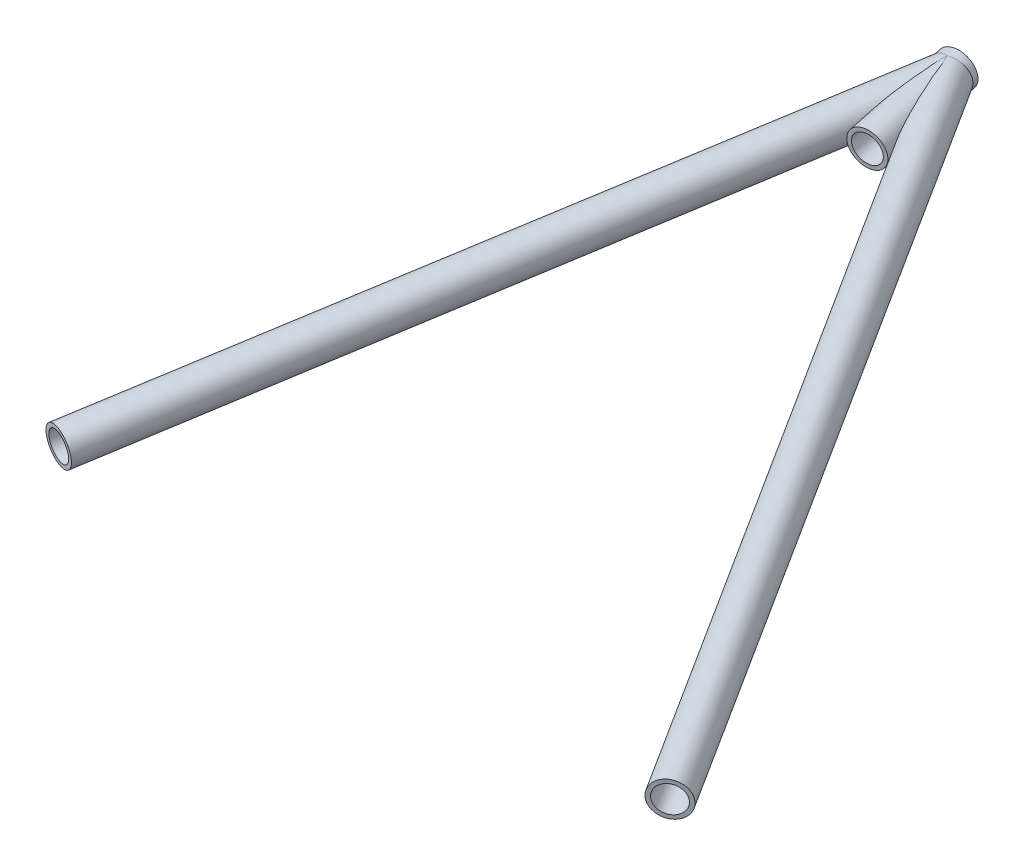
ISO-10303-21;
HEADER;
FILE_DESCRIPTION(('STEP AP214'),'2;1');
FILE_NAME('part.step','',(''),(''),'','','');
FILE_SCHEMA(('AUTOMOTIVE_DESIGN { 1 0 10303 214 1 1 1 1 }'));
ENDSEC;
DATA;
#1=APPLICATION_CONTEXT('core data for automotive mechanical design processes');
#2=APPLICATION_PROTOCOL_DEFINITION('international standard','automotive_design',2000,#1);
#3=PRODUCT_CONTEXT('',#1,'mechanical');
#4=PRODUCT('Part','Part','',(#3));
#5=PRODUCT_RELATED_PRODUCT_CATEGORY('part','',(#4));
#6=PRODUCT_DEFINITION_FORMATION('','',#4);
#7=PRODUCT_DEFINITION_CONTEXT('part definition',#1,'design');
#8=PRODUCT_DEFINITION('design','',#6,#7);
#9=PRODUCT_DEFINITION_SHAPE('','',#8);
#10=(LENGTH_UNIT() NAMED_UNIT(*) SI_UNIT(.MILLI.,.METRE.));
#11=(NAMED_UNIT(*) PLANE_ANGLE_UNIT() SI_UNIT($,.RADIAN.));
#12=(NAMED_UNIT(*) SI_UNIT($,.STERADIAN.) SOLID_ANGLE_UNIT());
#13=UNCERTAINTY_MEASURE_WITH_UNIT(LENGTH_MEASURE(1.E-05),#10,'distance_accuracy_value','');
#14=(GEOMETRIC_REPRESENTATION_CONTEXT(3) GLOBAL_UNCERTAINTY_ASSIGNED_CONTEXT((#13)) GLOBAL_UNIT_ASSIGNED_CONTEXT((#10,
#11,#12)) REPRESENTATION_CONTEXT('',''));
#15=CARTESIAN_POINT('',(0.,0.,0.));
#16=DIRECTION('',(0.,0.,1.));
#17=DIRECTION('',(1.,0.,0.));
#18=AXIS2_PLACEMENT_3D('',#15,#16,#17);
#19=CARTESIAN_POINT('',(1713.17260085528,131.13395858879,-611.724588998966));
#20=DIRECTION('',(0.512976736373104,-0.08229223970805,0.854448860508241));
#21=DIRECTION('',(0.857356807637054,0.,-0.514722550893585));
#22=AXIS2_PLACEMENT_3D('',#19,#20,#21);
#23=CYLINDRICAL_SURFACE('',#22,7.41680000000008);
#24=CARTESIAN_POINT('',(1932.04581422694,96.0220993887043,-247.154513007892));
#25=DIRECTION('',(-0.512976736373104,0.08229223970805,-0.854448860508241));
#26=DIRECTION('',(-0.857356807637054,0.,0.514722550893586));
#27=AXIS2_PLACEMENT_3D('',#24,#25,#26);
#28=CIRCLE('',#27,7.41680000000008);
#29=CARTESIAN_POINT('',(1925.68697025606,96.0220993887043,-243.336918792425));
#30=VERTEX_POINT('',#29);
#31=EDGE_CURVE('E109',#30,#30,#28,.T.);
#32=ORIENTED_EDGE('',*,*,#31,.F.);
#33=EDGE_LOOP('',(#32));
#34=FACE_BOUND('',#33,.T.);
#35=CARTESIAN_POINT('',(1723.05245629101,130.569114417633,-609.67734759782));
#36=CARTESIAN_POINT('',(1723.04654033207,130.377313286253,-609.687200454973));
#37=CARTESIAN_POINT('',(1723.03558764211,130.185341941127,-609.69093369608));
#38=CARTESIAN_POINT('',(1723.00385380998,129.802365240826,-609.685933915555));
#39=CARTESIAN_POINT('',(1722.98307189629,129.611359962669,-609.677199915247));
#40=CARTESIAN_POINT('',(1722.93212499311,129.231534671491,-609.646968784082));
#41=CARTESIAN_POINT('',(1722.90195592902,129.042715644421,-609.625466107161));
#42=CARTESIAN_POINT('',(1722.83291511719,128.668650539318,-609.569351607622));
#43=CARTESIAN_POINT('',(1722.79404354829,128.483404387946,-609.534740054384));
#44=CARTESIAN_POINT('',(1722.70843547749,128.117462600462,-609.451961973841));
#45=CARTESIAN_POINT('',(1722.66168551312,127.936775372678,-609.403772147867));
#46=CARTESIAN_POINT('',(1722.56153597079,127.581583555824,-609.293487379942));
#47=CARTESIAN_POINT('',(1722.50813634281,127.407079013274,-609.231392333392));
#48=CARTESIAN_POINT('',(1722.39615048155,127.065633452883,-609.093018034236));
#49=CARTESIAN_POINT('',(1722.33756721158,126.898688195146,-609.016746858512));
#50=CARTESIAN_POINT('',(1722.2168725192,126.573493043463,-608.849811285011));
#51=CARTESIAN_POINT('',(1722.15476126118,126.4152427451,-608.75914755742));
#52=CARTESIAN_POINT('',(1722.03096793333,126.113581909962,-608.566666492679));
#53=CARTESIAN_POINT('',(1721.9693382336,125.969855341315,-608.465310775417));
#54=CARTESIAN_POINT('',(1721.84639402671,125.69246511348,-608.249490273213));
#55=CARTESIAN_POINT('',(1721.78507950636,125.558801029791,-608.135026041785));
#56=CARTESIAN_POINT('',(1721.6646334476,125.302229610049,-607.893701630239));
#57=CARTESIAN_POINT('',(1721.605500971,125.179317619152,-607.766846865136));
#58=CARTESIAN_POINT('',(1721.49109552052,124.944525445904,-607.501715808001));
#59=CARTESIAN_POINT('',(1721.43582251283,124.832645166901,-607.363439616053));
#60=CARTESIAN_POINT('',(1721.33272886828,124.62429339617,-607.08269192494));
#61=CARTESIAN_POINT('',(1721.28469512182,124.527377197724,-606.940627421208));
#62=CARTESIAN_POINT('',(1721.1944119778,124.343384449913,-606.648543716566));
#63=CARTESIAN_POINT('',(1721.15216235441,124.256307516429,-606.498524826525));
#64=CARTESIAN_POINT('',(1721.07401202636,124.091430651227,-606.191864833834));
#65=CARTESIAN_POINT('',(1721.03811255351,124.013632520363,-606.035222453641));
#66=CARTESIAN_POINT('',(1720.97290333528,123.866616183222,-605.716645225286));
#67=CARTESIAN_POINT('',(1720.94359437323,123.79739899727,-605.55470975063));
#68=CARTESIAN_POINT('',(1720.8723843643,123.618606141324,-605.105911152147));
#69=CARTESIAN_POINT('',(1720.8371028269,123.516842924207,-604.814860950483));
#70=CARTESIAN_POINT('',(1720.78486574778,123.332410416336,-604.225156376746));
#71=CARTESIAN_POINT('',(1720.76792462366,123.249756187447,-603.926496210882));
#72=CARTESIAN_POINT('',(1720.75001694083,123.099486354441,-603.323894738933));
#73=CARTESIAN_POINT('',(1720.74910718808,123.031925065264,-603.019938471706));
#74=CARTESIAN_POINT('',(1720.75800604177,122.939832762813,-602.562493183076));
#75=CARTESIAN_POINT('',(1720.76268164796,122.910680083328,-602.409779309495));
#76=CARTESIAN_POINT('',(1720.77516899961,122.855135393918,-602.103974616504));
#77=CARTESIAN_POINT('',(1720.78298075231,122.82874339037,-601.950883796225));
#78=CARTESIAN_POINT('',(1720.80739152397,122.762324185192,-601.546358914043));
#79=CARTESIAN_POINT('',(1720.8264142541,122.724388011887,-601.294726988632));
#80=CARTESIAN_POINT('',(1720.87111220495,122.65413671667,-600.791254220738));
#81=CARTESIAN_POINT('',(1720.8967883909,122.621822411471,-600.539413353232));
#82=CARTESIAN_POINT('',(1720.95389437639,122.561995653237,-600.035689549966));
#83=CARTESIAN_POINT('',(1720.9853271153,122.534485667431,-599.783806658695));
#84=CARTESIAN_POINT('',(1721.05316611682,122.48365476674,-599.280282222038));
#85=CARTESIAN_POINT('',(1721.08957269973,122.460334121856,-599.028640693247));
#86=CARTESIAN_POINT('',(1721.20541931619,122.395777024535,-598.273050362963));
#87=CARTESIAN_POINT('',(1721.2913459101,122.360080490864,-597.769617080901));
#88=CARTESIAN_POINT('',(1721.47626198241,122.300612219466,-596.764658809902));
#89=CARTESIAN_POINT('',(1721.57524807191,122.27683739574,-596.263133360506));
#90=CARTESIAN_POINT('',(1721.78436439084,122.23932364899,-595.256904932338));
#91=CARTESIAN_POINT('',(1721.89459453669,122.225685601338,-594.752219132698));
#92=CARTESIAN_POINT('',(1722.12312635943,122.207789909182,-593.744498828002));
#93=CARTESIAN_POINT('',(1722.24142849574,122.203532799068,-593.241464418647));
#94=CARTESIAN_POINT('',(1722.48418017973,122.203856314525,-592.237913525998));
#95=CARTESIAN_POINT('',(1722.60861748857,122.208419987753,-591.737394062699));
#96=CARTESIAN_POINT('',(1722.86255967634,122.226169051773,-590.737814713578));
#97=CARTESIAN_POINT('',(1722.99206442808,122.239354226298,-590.238754791459));
#98=CARTESIAN_POINT('',(1723.28100577327,122.277897595185,-589.143972763658));
#99=CARTESIAN_POINT('',(1723.44131906471,122.305140156573,-588.548547422757));
#100=CARTESIAN_POINT('',(1723.76638569234,122.372789546001,-587.359614267569));
#101=CARTESIAN_POINT('',(1723.93113933475,122.413197284102,-586.766106588708));
#102=CARTESIAN_POINT('',(1724.26445112291,122.508571585529,-585.579406274474));
#103=CARTESIAN_POINT('',(1724.43301911512,122.563581033968,-584.986219810543));
#104=CARTESIAN_POINT('',(1724.77245515445,122.690081235806,-583.802371953746));
#105=CARTESIAN_POINT('',(1724.9433227723,122.761568952329,-583.211710116006));
#106=CARTESIAN_POINT('',(1725.28395037135,122.922852028021,-582.041913127049));
#107=CARTESIAN_POINT('',(1725.45369071435,123.012368096081,-581.46273469764));
#108=CARTESIAN_POINT('',(1725.70854870001,123.164262049089,-580.596887974645));
#109=CARTESIAN_POINT('',(1725.79357651002,123.217854859657,-580.308645039762));
#110=CARTESIAN_POINT('',(1725.96352599184,123.331737476364,-579.733454324624));
#111=CARTESIAN_POINT('',(1726.04844766716,123.392027054658,-579.446506500651));
#112=CARTESIAN_POINT('',(1726.21759670224,123.520037674093,-578.875547402489));
#113=CARTESIAN_POINT('',(1726.30182546207,123.587723554968,-578.591528703547));
#114=CARTESIAN_POINT('',(1726.4697104338,123.732098336937,-578.025622766102));
#115=CARTESIAN_POINT('',(1726.55336669129,123.808786512203,-577.743735357707));
#116=CARTESIAN_POINT('',(1726.71963907114,123.972912544411,-577.183196215688));
#117=CARTESIAN_POINT('',(1726.80225637319,124.060336709565,-576.904540846769));
#118=CARTESIAN_POINT('',(1726.96599963226,124.248574245335,-576.351380074664));
#119=CARTESIAN_POINT('',(1727.04712620244,124.349381964134,-576.076872973887));
#120=CARTESIAN_POINT('',(1727.14692251124,124.486025341449,-575.7380825857));
#121=CARTESIAN_POINT('',(1727.16671393903,124.513758726626,-575.670838503921));
#122=CARTESIAN_POINT('',(1727.2061294634,124.570382912259,-575.536787143864));
#123=CARTESIAN_POINT('',(1727.22575355519,124.599273745869,-575.469979878162));
#124=CARTESIAN_POINT('',(1727.28435196274,124.687820610514,-575.270262488974));
#125=CARTESIAN_POINT('',(1727.32304337925,124.749338742417,-575.138087416282));
#126=CARTESIAN_POINT('',(1727.39949081988,124.878245939998,-574.876121609656));
#127=CARTESIAN_POINT('',(1727.43724569603,124.945641793731,-574.746333847873));
#128=CARTESIAN_POINT('',(1727.51142644802,125.087293794141,-574.490227519062));
#129=CARTESIAN_POINT('',(1727.54785266501,125.161548162237,-574.363908063578));
#130=CARTESIAN_POINT('',(1727.63481611861,125.353286830789,-574.060510914929));
#131=CARTESIAN_POINT('',(1727.68440958377,125.475291895177,-573.885893473436));
#132=CARTESIAN_POINT('',(1727.75415421182,125.675294202062,-573.63650875239));
#133=CARTESIAN_POINT('',(1727.77661234912,125.744732936298,-573.555529408285));
#134=CARTESIAN_POINT('',(1727.81948762507,125.890180182632,-573.399161870165));
#135=CARTESIAN_POINT('',(1727.83990627244,125.966183759572,-573.323769553939));
#136=CARTESIAN_POINT('',(1727.88002988058,126.133948103504,-573.173052164775));
#137=CARTESIAN_POINT('',(1727.89944210014,126.226525571001,-573.098542132831));
#138=CARTESIAN_POINT('',(1727.93372089541,126.421592146569,-572.962511865748));
#139=CARTESIAN_POINT('',(1727.94859396864,126.524066807959,-572.900973102462));
#140=CARTESIAN_POINT('',(1727.9703688576,126.721305130092,-572.804172833107));
#141=CARTESIAN_POINT('',(1727.9781683592,126.814655300222,-572.766276163256));
#142=CARTESIAN_POINT('',(1727.9886360929,127.006497014591,-572.705943546994));
#143=CARTESIAN_POINT('',(1727.99131000185,127.104982746569,-572.683490513701));
#144=CARTESIAN_POINT('',(1727.99110333081,127.30466275826,-572.655718258056));
#145=CARTESIAN_POINT('',(1727.98820592868,127.405864328365,-572.650451056551));
#146=CARTESIAN_POINT('',(1727.97707313307,127.607437401087,-572.656874898471));
#147=CARTESIAN_POINT('',(1727.96883271801,127.707808032787,-572.66858190779));
#148=CARTESIAN_POINT('',(1727.94506210844,127.93076355568,-572.711846518752));
#149=CARTESIAN_POINT('',(1727.92819322461,128.052335118458,-572.747775707289));
#150=CARTESIAN_POINT('',(1727.88912348547,128.287701845822,-572.837620625341));
#151=CARTESIAN_POINT('',(1727.86691075087,128.401478949115,-572.89157653333));
#152=CARTESIAN_POINT('',(1727.82203384034,128.605973058439,-573.004270539063));
#153=CARTESIAN_POINT('',(1727.79983990089,128.697724245082,-573.061366303878));
#154=CARTESIAN_POINT('',(1727.75337965479,128.875670381991,-573.182972871904));
#155=CARTESIAN_POINT('',(1727.72911168024,128.96186076074,-573.247489657656));
#156=CARTESIAN_POINT('',(1727.67898802284,129.129385125038,-573.382324532379));
#157=CARTESIAN_POINT('',(1727.65312877933,129.210707352104,-573.45265576215));
#158=CARTESIAN_POINT('',(1727.60025467923,129.368843032192,-573.597718249923));
#159=CARTESIAN_POINT('',(1727.57324020902,129.445657972714,-573.672448039813));
#160=CARTESIAN_POINT('',(1727.50400492049,129.634361753042,-573.865271202049));
#161=CARTESIAN_POINT('',(1727.46119471828,129.743672367138,-573.985671502339));
#162=CARTESIAN_POINT('',(1727.37412769178,129.954798805285,-574.23241613044));
#163=CARTESIAN_POINT('',(1727.32987010012,130.056610557549,-574.358763627362));
#164=CARTESIAN_POINT('',(1727.24024816083,130.25407673097,-574.616167440291));
#165=CARTESIAN_POINT('',(1727.19488196415,130.349719737163,-574.747231824044));
#166=CARTESIAN_POINT('',(1727.10339164071,130.535605791726,-575.012882962832));
#167=CARTESIAN_POINT('',(1727.05726742402,130.625848193371,-575.147470136961));
#168=CARTESIAN_POINT('',(1726.96419798409,130.802161088826,-575.420224465398));
#169=CARTESIAN_POINT('',(1726.91724960088,130.888205239722,-575.558407506878));
#170=CARTESIAN_POINT('',(1726.82292803408,131.056178552793,-575.837109482565));
#171=CARTESIAN_POINT('',(1726.77555483459,131.138107560182,-575.977628504372));
#172=CARTESIAN_POINT('',(1726.68055076136,131.298234146016,-576.260438223727));
#173=CARTESIAN_POINT('',(1726.63292027664,131.376436193937,-576.402726527262));
#174=CARTESIAN_POINT('',(1726.53742703123,131.529605487745,-576.688947920995));
#175=CARTESIAN_POINT('',(1726.48956427451,131.604572788616,-576.832880983182));
#176=CARTESIAN_POINT('',(1726.34499967611,131.826243070369,-577.26898865864));
#177=CARTESIAN_POINT('',(1726.24803946553,131.968518096491,-577.563333408426));
#178=CARTESIAN_POINT('',(1726.05382647221,132.243381675934,-578.156436015282));
#179=CARTESIAN_POINT('',(1725.95657364764,132.375968768313,-578.455194529816));
#180=CARTESIAN_POINT('',(1725.76201376865,132.63297044007,-579.056367004211));
#181=CARTESIAN_POINT('',(1725.664706711,132.757380986967,-579.358782681936));
#182=CARTESIAN_POINT('',(1725.47029788569,132.999071352768,-579.966525491397));
#183=CARTESIAN_POINT('',(1725.37319612925,133.116350791504,-580.271852777352));
#184=CARTESIAN_POINT('',(1725.17915207025,133.344893093205,-580.885695794895));
#185=CARTESIAN_POINT('',(1725.08221069603,133.45614098482,-581.194217382211));
#186=CARTESIAN_POINT('',(1724.88888063237,133.672983142699,-581.813416551023));
#187=CARTESIAN_POINT('',(1724.79249195817,133.778577253542,-582.124094191524));
#188=CARTESIAN_POINT('',(1724.50444502648,134.087634640036,-583.058790705019));
#189=CARTESIAN_POINT('',(1724.31384217685,134.283446981898,-583.68567433358));
#190=CARTESIAN_POINT('',(1723.93686895751,134.657541361915,-584.945229958343));
#191=CARTESIAN_POINT('',(1723.7504950605,134.835838456078,-585.57789646304));
#192=CARTESIAN_POINT('',(1723.38318939233,135.177001527154,-586.849006701281));
#193=CARTESIAN_POINT('',(1723.20225810942,135.339866122437,-587.487450946495));
#194=CARTESIAN_POINT('',(1722.84786708533,135.651005369213,-588.768918344349));
#195=CARTESIAN_POINT('',(1722.67439715532,135.799300296471,-589.411933758914));
#196=CARTESIAN_POINT('',(1722.33699000706,136.08188502393,-590.703475440731));
#197=CARTESIAN_POINT('',(1722.17305190343,136.216176125836,-591.352001189706));
#198=CARTESIAN_POINT('',(1721.88774876259,136.446209178538,-592.531832471643));
#199=CARTESIAN_POINT('',(1721.76419403631,136.544439536494,-593.062122762843));
#200=CARTESIAN_POINT('',(1721.5278832215,136.730521618372,-594.127113710472));
#201=CARTESIAN_POINT('',(1721.41513000987,136.818370578741,-594.66181550091));
#202=CARTESIAN_POINT('',(1721.25669485208,136.941078243437,-595.467259549226));
#203=CARTESIAN_POINT('',(1721.20567214448,136.980464823488,-595.73626719979));
#204=CARTESIAN_POINT('',(1721.10774431697,137.055894834217,-596.275494325697));
#205=CARTESIAN_POINT('',(1721.06083905378,137.091938381242,-596.545713758522));
#206=CARTESIAN_POINT('',(1720.97180059786,137.160265669107,-597.087351620025));
#207=CARTESIAN_POINT('',(1720.92966628007,137.192550296421,-597.358769750276));
#208=CARTESIAN_POINT('',(1720.85094140363,137.25281788767,-597.902876119974));
#209=CARTESIAN_POINT('',(1720.81435057926,137.280801057791,-598.175564297895));
#210=CARTESIAN_POINT('',(1720.73779935068,137.339270311498,-598.802815188736));
#211=CARTESIAN_POINT('',(1720.70002641696,137.368061687218,-599.157812427505));
#212=CARTESIAN_POINT('',(1720.63780007058,137.415104339226,-599.86980885644));
#213=CARTESIAN_POINT('',(1720.61334964995,137.433353247891,-600.226808478138));
#214=CARTESIAN_POINT('',(1720.58089412748,137.456182895289,-600.941543828652));
#215=CARTESIAN_POINT('',(1720.57286492241,137.460783671366,-601.299277705975));
#216=CARTESIAN_POINT('',(1720.57684445117,137.451995329802,-602.014412921783));
#217=CARTESIAN_POINT('',(1720.5888405537,137.438617553472,-602.371814327721));
#218=CARTESIAN_POINT('',(1720.62728094086,137.397812353018,-602.94364577828));
#219=CARTESIAN_POINT('',(1720.64620477468,137.377961852585,-603.159123716042));
#220=CARTESIAN_POINT('',(1720.69358362457,137.327727439894,-603.587771761716));
#221=CARTESIAN_POINT('',(1720.72203547175,137.297347029626,-603.800942612632));
#222=CARTESIAN_POINT('',(1720.78890795805,137.224303600442,-604.22326985497));
#223=CARTESIAN_POINT('',(1720.82731262239,137.181660252263,-604.432432107867));
#224=CARTESIAN_POINT('',(1720.91415266722,137.082230302288,-604.845262561577));
#225=CARTESIAN_POINT('',(1720.96258603365,137.025446539838,-605.04893185627));
#226=CARTESIAN_POINT('',(1721.0606234992,136.906114628933,-605.417674337204));
#227=CARTESIAN_POINT('',(1721.10888200087,136.845824944191,-605.583835973428));
#228=CARTESIAN_POINT('',(1721.21131376055,136.713201416826,-605.909379685184));
#229=CARTESIAN_POINT('',(1721.26548584339,136.640869965699,-606.068763098999));
#230=CARTESIAN_POINT('',(1721.37857583728,136.483680020401,-606.379497782779));
#231=CARTESIAN_POINT('',(1721.43749415951,136.39882044037,-606.530848354961));
#232=CARTESIAN_POINT('',(1721.55856778639,136.216468401279,-606.824379270386));
#233=CARTESIAN_POINT('',(1721.62072316975,136.118975634999,-606.966559390491));
#234=CARTESIAN_POINT('',(1721.74662469165,135.91150064187,-607.241009108491));
#235=CARTESIAN_POINT('',(1721.81037246232,135.8015051529,-607.373267931014));
#236=CARTESIAN_POINT('',(1721.93760793841,135.569674836324,-607.627100692577));
#237=CARTESIAN_POINT('',(1722.00109563875,135.447839778569,-607.748674423824));
#238=CARTESIAN_POINT('',(1722.12611174923,135.193063895975,-607.980851517193));
#239=CARTESIAN_POINT('',(1722.18763896734,135.060116486008,-608.091448288288));
#240=CARTESIAN_POINT('',(1722.30709748487,134.78415020043,-608.301439824914));
#241=CARTESIAN_POINT('',(1722.36502878167,134.641131317514,-608.400834582319));
#242=CARTESIAN_POINT('',(1722.475145828,134.34807553776,-608.5871495931));
#243=CARTESIAN_POINT('',(1722.52739826433,134.198158618163,-608.674219388284));
#244=CARTESIAN_POINT('',(1722.6258899732,133.890641347062,-608.837505815819));
#245=CARTESIAN_POINT('',(1722.67212924149,133.733040990139,-608.913722440514));
#246=CARTESIAN_POINT('',(1722.75763864707,133.41130052742,-609.055370803047));
#247=CARTESIAN_POINT('',(1722.79691065637,133.247162192851,-609.12080543753));
#248=CARTESIAN_POINT('',(1722.86775060106,132.913411083176,-609.240995818702));
#249=CARTESIAN_POINT('',(1722.89931876247,132.743798468842,-609.295751878676));
#250=CARTESIAN_POINT('',(1722.95254974927,132.410446891782,-609.391690965734));
#251=CARTESIAN_POINT('',(1722.9746908399,132.246960449564,-609.433488491917));
#252=CARTESIAN_POINT('',(1723.01133528768,131.916973562253,-609.507713074967));
#253=CARTESIAN_POINT('',(1723.02583615056,131.750472151215,-609.540137070176));
#254=CARTESIAN_POINT('',(1723.0469838483,131.415397173538,-609.595571402671));
#255=CARTESIAN_POINT('',(1723.05362981834,131.246823380796,-609.61858070323));
#256=CARTESIAN_POINT('',(1723.05898350411,130.908582098071,-609.655106001696));
#257=CARTESIAN_POINT('',(1723.05769365864,130.738914960097,-609.668624914709));
#258=CARTESIAN_POINT('',(1723.05245629101,130.569114417633,-609.67734759782));
#259=B_SPLINE_CURVE_WITH_KNOTS('',3,(#35,#36,#37,#38,#39,#40,#41,#42,#43,#44,#45,#46,#47,#48,
#49,#50,#51,#52,#53,#54,#55,#56,#57,#58,#59,#60,#61,#62,#63,#64,#65,#66,#67,#68,#69,#70,#71,#72,
#73,#74,#75,#76,#77,#78,#79,#80,#81,#82,#83,#84,#85,#86,#87,#88,#89,#90,#91,#92,#93,#94,#95,#96,
#97,#98,#99,#100,#101,#102,#103,#104,#105,#106,#107,#108,#109,#110,#111,#112,#113,#114,#115,
#116,#117,#118,#119,#120,#121,#122,#123,#124,#125,#126,#127,#128,#129,#130,#131,#132,#133,#134,
#135,#136,#137,#138,#139,#140,#141,#142,#143,#144,#145,#146,#147,#148,#149,#150,#151,#152,#153,
#154,#155,#156,#157,#158,#159,#160,#161,#162,#163,#164,#165,#166,#167,#168,#169,#170,#171,#172,
#173,#174,#175,#176,#177,#178,#179,#180,#181,#182,#183,#184,#185,#186,#187,#188,#189,#190,#191,
#192,#193,#194,#195,#196,#197,#198,#199,#200,#201,#202,#203,#204,#205,#206,#207,#208,#209,#210,
#211,#212,#213,#214,#215,#216,#217,#218,#219,#220,#221,#222,#223,#224,#225,#226,#227,#228,#229,
#230,#231,#232,#233,#234,#235,#236,#237,#238,#239,#240,#241,#242,#243,#244,#245,#246,#247,#248,
#249,#250,#251,#252,#253,#254,#255,#256,#257,#258),.UNSPECIFIED.,.T.,.F.,(4,2,2,2,2,2,2,2,2,2,2,
2,2,2,2,2,2,2,2,2,2,2,2,2,2,2,2,2,2,2,2,2,2,2,2,2,2,2,2,2,2,2,2,2,2,2,2,2,2,2,2,2,2,2,2,2,2,2,2,
2,2,2,2,2,2,2,2,2,2,2,2,2,2,2,2,2,2,2,2,2,2,2,2,2,2,2,2,2,2,2,2,2,2,2,2,2,2,2,2,2,2,2,2,2,2,2,2,
2,2,2,2,4),(0.,0.5762905985785,1.15262643841304,1.72921279252587,2.30578729873162,
2.88335722553767,3.46093149720245,4.03817769780171,4.6153970269364,5.17374293840111,
5.73206528202877,6.2901447054839,6.84821923902869,7.38332139769753,7.91840265917229,
8.45358760228693,8.98883612112741,9.91821558798152,10.8483251209369,11.7817297668767,
12.248312295847,12.7148959022911,13.4802640933417,14.2457433798635,15.0116146248162,
15.7775352122352,17.3129644784832,18.8479960853233,20.3981061111411,21.9483044373709,
23.4955264560109,25.0427096648364,26.894241564471,28.7459014807718,30.6030610640594,
32.459878653906,34.289881738979,35.2056127640783,36.1213126427637,37.0328347320155,
37.9442833782823,38.8545814805171,39.7644963833476,39.9906376729429,40.2167854445226,
40.6691835878372,41.1221112955511,41.5749218759369,42.2294771016718,42.5562421436365,
42.8827636411422,43.2430896948133,43.602897517992,43.9047945559671,44.2063570346246,
44.5088314885144,44.8115906336242,45.1931073454155,45.5754801293267,45.9059684843568,
46.2367251587558,46.5682509340919,46.8996666764028,47.4037574122136,47.9081198753821,
48.4133903378055,48.9187211861735,49.426896527911,49.9350909696096,50.4426597895652,
50.9502199783058,51.972994654346,52.9959232479572,54.0193525981185,55.0428364607878,
56.0687542821779,57.0947002915324,59.145921824268,61.1953644200527,63.2449903239969,
65.2917222326139,67.3382637204383,68.9979468942732,70.6580708895933,71.4878942705656,
72.3176887604122,73.1472871597566,73.9768457805912,75.0509957550787,76.1253868682501,
77.1981998442995,78.2703363812202,78.9215935251996,79.5726342845615,80.2226364925022,
80.8725082872918,81.4216289862148,81.9706407594928,82.5197001456041,83.068772886459,
83.6184335829981,84.1681049664559,84.7181044239535,85.2681042804134,85.8107211981469,
86.3533384986249,86.8958097832951,87.4382651506712,87.9483864345856,88.4586741506583,
88.9690180434485,89.4792051083131),.UNSPECIFIED.);
#260=CARTESIAN_POINT('',(1723.05245629101,130.569114417633,-609.67734759782));
#261=VERTEX_POINT('',#260);
#262=EDGE_CURVE('E83',#261,#261,#259,.T.);
#263=ORIENTED_EDGE('',*,*,#262,.T.);
#264=EDGE_LOOP('',(#263));
#265=FACE_BOUND('',#264,.T.);
#266=ADVANCED_FACE('F65',(#34,#265),#23,.F.);
#267=CARTESIAN_POINT('',(1719.75176820433,126.102654339161,-562.415355233465));
#268=DIRECTION('',(-0.131583346980973,0.100626084992588,-0.98618467531003));
#269=DIRECTION('',(-0.991215775128284,0.,0.132254629925897));
#270=AXIS2_PLACEMENT_3D('',#267,#268,#269);
#271=CYLINDRICAL_SURFACE('',#270,9.52500000000004);
#272=ORIENTED_EDGE('',*,*,#262,.F.);
#273=EDGE_LOOP('',(#272));
#274=FACE_BOUND('',#273,.T.);
#275=CARTESIAN_POINT('',(1713.17260085528,131.13395858879,-611.724588998964));
#276=DIRECTION('',(0.944230002344393,0.0453897924229676,-0.326143326493902));
#277=DIRECTION('',(0.329060742994004,-0.0933834430453637,0.93968003064087));
#278=AXIS2_PLACEMENT_3D('',#275,#276,#277);
#279=ELLIPSE('',#278,47.1628036692757,9.525);
#280=CARTESIAN_POINT('',(1713.28876294306,121.660440805419,-612.706725536065));
#281=VERTEX_POINT('',#280);
#282=CARTESIAN_POINT('',(1713.05643876749,140.607476372162,-610.742452461863));
#283=VERTEX_POINT('',#282);
#284=EDGE_CURVE('E74',#281,#283,#279,.F.);
#285=ORIENTED_EDGE('',*,*,#284,.T.);
#286=CARTESIAN_POINT('',(1713.17260085528,131.13395858879,-611.724588998964));
#287=DIRECTION('',(0.329060742994004,-0.0933834430453637,0.93968003064087));
#288=DIRECTION('',(0.944230002344393,0.0453897924229676,-0.326143326493902));
#289=AXIS2_PLACEMENT_3D('',#286,#287,#288);
#290=ELLIPSE('',#289,9.72540390868764,9.525);
#291=EDGE_CURVE('E13',#283,#281,#290,.F.);
#292=ORIENTED_EDGE('',*,*,#291,.T.);
#293=EDGE_LOOP('',(#285,#292));
#294=FACE_BOUND('',#293,.T.);
#295=ADVANCED_FACE('F81',(#274,#294),#271,.F.);
#296=CARTESIAN_POINT('',(1713.17260085528,131.13395858879,-611.724588998966));
#297=DIRECTION('',(0.512976736373104,-0.08229223970805,0.854448860508241));
#298=DIRECTION('',(0.857356807637054,0.,-0.514722550893585));
#299=AXIS2_PLACEMENT_3D('',#296,#297,#298);
#300=CYLINDRICAL_SURFACE('',#299,9.52499999999996);
#301=CARTESIAN_POINT('',(1932.04581422694,96.0220993887043,-247.154513007892));
#302=DIRECTION('',(-0.512976736373104,0.08229223970805,-0.854448860508241));
#303=DIRECTION('',(-0.857356807637054,0.,0.514722550893586));
#304=AXIS2_PLACEMENT_3D('',#301,#302,#303);
#305=CIRCLE('',#304,9.52499999999996);
#306=CARTESIAN_POINT('',(1923.8794906342,96.0220993887043,-242.251780710631));
#307=VERTEX_POINT('',#306);
#308=EDGE_CURVE('E69',#307,#307,#305,.T.);
#309=ORIENTED_EDGE('',*,*,#308,.T.);
#310=EDGE_LOOP('',(#309));
#311=FACE_BOUND('',#310,.T.);
#312=ORIENTED_EDGE('',*,*,#284,.F.);
#313=ORIENTED_EDGE('',*,*,#291,.F.);
#314=EDGE_LOOP('',(#312,#313));
#315=FACE_BOUND('',#314,.T.);
#316=ADVANCED_FACE('F67',(#311,#315),#300,.T.);
#317=CARTESIAN_POINT('',(1932.04581422694,96.0220993887044,-247.154513007892));
#318=DIRECTION('',(-0.512976736373104,0.08229223970805,-0.854448860508241));
#319=DIRECTION('',(-0.857356807637054,0.,0.514722550893586));
#320=AXIS2_PLACEMENT_3D('',#317,#318,#319);
#321=PLANE('',#320);
#322=ORIENTED_EDGE('',*,*,#31,.T.);
#323=EDGE_LOOP('',(#322));
#324=FACE_BOUND('',#323,.T.);
#325=ORIENTED_EDGE('',*,*,#308,.F.);
#326=EDGE_LOOP('',(#325));
#327=FACE_BOUND('',#326,.T.);
#328=ADVANCED_FACE('F86',(#324,#327),#321,.F.);
#329=CLOSED_SHELL('',(#266,#295,#316,#328));
#330=MANIFOLD_SOLID_BREP('B2',#329);
#331=CARTESIAN_POINT('',(1600.,88.8502518080079,-217.248802890104));
#332=DIRECTION('',(0.274316838299431,0.102490644096067,-0.956162088820811));
#333=DIRECTION('',(-0.961223924389069,0.,-0.275769046816492));
#334=AXIS2_PLACEMENT_3D('',#331,#332,#333);
#335=CYLINDRICAL_SURFACE('',#334,7.41680000000008);
#336=CARTESIAN_POINT('',(1609.60108934048,92.4374243513702,-250.714475998832));
#337=DIRECTION('',(0.274316838299431,0.102490644096067,-0.956162088820811));
#338=DIRECTION('',(-0.96122392438907,0.,-0.275769046816492));
#339=AXIS2_PLACEMENT_3D('',#336,#337,#338);
#340=CIRCLE('',#339,7.41680000000008);
#341=CARTESIAN_POINT('',(1602.47188373807,92.4374243513702,-252.759799865261));
#342=VERTEX_POINT('',#341);
#343=EDGE_CURVE('E184',#342,#342,#340,.T.);
#344=ORIENTED_EDGE('',*,*,#343,.F.);
#345=EDGE_LOOP('',(#344));
#346=FACE_BOUND('',#345,.T.);
#347=CARTESIAN_POINT('',(1704.16915790004,130.433703385095,-607.237048483694));
#348=CARTESIAN_POINT('',(1704.16399077324,130.626588998975,-607.219033881927));
#349=CARTESIAN_POINT('',(1704.16540530266,130.819281558209,-607.196394251857));
#350=CARTESIAN_POINT('',(1704.1813770738,131.202905341836,-607.141967483448));
#351=CARTESIAN_POINT('',(1704.19594213303,131.393835450306,-607.11017491168));
#352=CARTESIAN_POINT('',(1704.23805567209,131.772948573631,-607.037340005222));
#353=CARTESIAN_POINT('',(1704.26563419309,131.961124188121,-606.996276383592));
#354=CARTESIAN_POINT('',(1704.33337705444,132.332881747878,-606.904804568348));
#355=CARTESIAN_POINT('',(1704.37354129535,132.516463729427,-606.854396448566));
#356=CARTESIAN_POINT('',(1704.46585660825,132.877707098577,-606.743964816532));
#357=CARTESIAN_POINT('',(1704.51801205661,133.055366297404,-606.683937796158));
#358=CARTESIAN_POINT('',(1704.63346009951,133.403286266749,-606.553931925536));
#359=CARTESIAN_POINT('',(1704.69675315362,133.573546731618,-606.48395266466));
#360=CARTESIAN_POINT('',(1704.83331810417,133.905100084552,-606.33369454951));
#361=CARTESIAN_POINT('',(1704.90658128143,134.066400636664,-606.253424698183));
#362=CARTESIAN_POINT('',(1705.06175584714,134.378797186812,-606.082104958726));
#363=CARTESIAN_POINT('',(1705.14366685982,134.529893627774,-605.991055538972));
#364=CARTESIAN_POINT('',(1705.31230561934,134.816867969547,-605.800247785144));
#365=CARTESIAN_POINT('',(1705.39885802946,134.953035062472,-605.700769615719));
#366=CARTESIAN_POINT('',(1705.57681119888,135.213328221495,-605.490980346471));
#367=CARTESIAN_POINT('',(1705.66821180405,135.337454669997,-605.380669590911));
#368=CARTESIAN_POINT('',(1705.85382700765,135.572722291596,-605.14926990721));
#369=CARTESIAN_POINT('',(1705.94804002065,135.68387061347,-605.02818697812));
#370=CARTESIAN_POINT('',(1706.13725119627,135.892690198147,-604.775482834942));
#371=CARTESIAN_POINT('',(1706.23224932658,135.990362012752,-604.64386205268));
#372=CARTESIAN_POINT('',(1706.41567781871,136.166926011533,-604.378432153677));
#373=CARTESIAN_POINT('',(1706.50417605965,136.2465673442,-604.245166606849));
#374=CARTESIAN_POINT('',(1706.67857074584,136.393926755853,-603.970580827279));
#375=CARTESIAN_POINT('',(1706.76446696554,136.461643803552,-603.829259899254));
#376=CARTESIAN_POINT('',(1706.93239928544,136.585669705703,-603.539554155033));
#377=CARTESIAN_POINT('',(1707.0144360059,136.641980398076,-603.391170481633));
#378=CARTESIAN_POINT('',(1707.17378151406,136.744005633777,-603.088357015416));
#379=CARTESIAN_POINT('',(1707.25108965166,136.789718722529,-602.93392639602));
#380=CARTESIAN_POINT('',(1707.44038371105,136.893396174057,-602.536022305));
#381=CARTESIAN_POINT('',(1707.54878656909,136.944824515549,-602.289125749296));
#382=CARTESIAN_POINT('',(1707.75247874519,137.028694357763,-601.786850906199));
#383=CARTESIAN_POINT('',(1707.84776019078,137.061124497766,-601.531467640095));
#384=CARTESIAN_POINT('',(1708.02604618595,137.110606759745,-601.013989913246));
#385=CARTESIAN_POINT('',(1708.10900409329,137.127601643368,-600.751874149483));
#386=CARTESIAN_POINT('',(1708.22473684975,137.143669300373,-600.355899556627));
#387=CARTESIAN_POINT('',(1708.26186164549,137.147454467461,-600.223449800737));
#388=CARTESIAN_POINT('',(1708.33338801329,137.152200737703,-599.957761109431));
#389=CARTESIAN_POINT('',(1708.36778954049,137.15316179436,-599.824522161058));
#390=CARTESIAN_POINT('',(1708.44942647965,137.152409095601,-599.495357474075));
#391=CARTESIAN_POINT('',(1708.49519756677,137.14924493869,-599.299071555874));
#392=CARTESIAN_POINT('',(1708.58177429116,137.138250861155,-598.905529270086));
#393=CARTESIAN_POINT('',(1708.6225792987,137.130420349541,-598.708272782716));
#394=CARTESIAN_POINT('',(1708.73833105913,137.10090371449,-598.115329075253));
#395=CARTESIAN_POINT('',(1708.80657666361,137.073193935801,-597.718624128738));
#396=CARTESIAN_POINT('',(1708.92880515216,137.005472217018,-596.92329265206));
#397=CARTESIAN_POINT('',(1708.98275683164,136.965433767667,-596.524663821032));
#398=CARTESIAN_POINT('',(1709.07900333903,136.875603000916,-595.727216647698));
#399=CARTESIAN_POINT('',(1709.12130068036,136.825812790586,-595.328398364866));
#400=CARTESIAN_POINT('',(1709.19665096414,136.71789460621,-594.528887392476));
#401=CARTESIAN_POINT('',(1709.229654071,136.65972412103,-594.128195887418));
#402=CARTESIAN_POINT('',(1709.28786577284,136.53639965335,-593.327318825368));
#403=CARTESIAN_POINT('',(1709.31307403592,136.471245373654,-592.927133290642));
#404=CARTESIAN_POINT('',(1709.35703549867,136.334811387598,-592.127969167727));
#405=CARTESIAN_POINT('',(1709.37579658543,136.263539299838,-591.72898970094));
#406=CARTESIAN_POINT('',(1709.40798272446,136.115300086116,-590.931886776615));
#407=CARTESIAN_POINT('',(1709.4214078519,136.03833304041,-590.533763307093));
#408=CARTESIAN_POINT('',(1709.44535232465,135.867841028585,-589.682741239436));
#409=CARTESIAN_POINT('',(1709.45520070472,135.77350727581,-589.229986054807));
#410=CARTESIAN_POINT('',(1709.47009611838,135.578041760709,-588.325865483068));
#411=CARTESIAN_POINT('',(1709.47514309684,135.476909920344,-587.874500111974));
#412=CARTESIAN_POINT('',(1709.48123733788,135.267813860281,-586.973134984571));
#413=CARTESIAN_POINT('',(1709.48228296977,135.15984687323,-586.523135859689));
#414=CARTESIAN_POINT('',(1709.48101556026,134.936952248108,-585.624873086335));
#415=CARTESIAN_POINT('',(1709.47870254397,134.822024662064,-585.176609424919));
#416=CARTESIAN_POINT('',(1709.47125905446,134.585342052899,-584.283806952574));
#417=CARTESIAN_POINT('',(1709.46613975769,134.463615822409,-583.839260421789));
#418=CARTESIAN_POINT('',(1709.45352300352,134.212417720048,-582.952395991245));
#419=CARTESIAN_POINT('',(1709.44602556707,134.082945916414,-582.51007807189));
#420=CARTESIAN_POINT('',(1709.42902011134,133.815580860101,-581.62817225892));
#421=CARTESIAN_POINT('',(1709.41951269354,133.677690135479,-581.188583589016));
#422=CARTESIAN_POINT('',(1709.3988024134,133.392482792036,-580.312528587989));
#423=CARTESIAN_POINT('',(1709.38759962831,133.245166602866,-579.87606211555));
#424=CARTESIAN_POINT('',(1709.36376858887,132.939613981955,-579.006476417877));
#425=CARTESIAN_POINT('',(1709.3511388534,132.781366271231,-578.573361178472));
#426=CARTESIAN_POINT('',(1709.32472839561,132.452214573828,-577.711902588916));
#427=CARTESIAN_POINT('',(1709.31094748304,132.281308495672,-577.283560040843));
#428=CARTESIAN_POINT('',(1709.2824856646,131.924016834577,-576.43267709632));
#429=CARTESIAN_POINT('',(1709.26780361115,131.737611401591,-576.010144973707));
#430=CARTESIAN_POINT('',(1709.24535307803,131.44360636238,-575.383193369539));
#431=CARTESIAN_POINT('',(1709.23779938082,131.343219827083,-575.175378386201));
#432=CARTESIAN_POINT('',(1709.22259600485,131.136930169088,-574.762515127525));
#433=CARTESIAN_POINT('',(1709.2149463332,131.031027453257,-574.557466649533));
#434=CARTESIAN_POINT('',(1709.19958197572,130.812486671093,-574.150150827668));
#435=CARTESIAN_POINT('',(1709.19186716128,130.699828538729,-573.947894212248));
#436=CARTESIAN_POINT('',(1709.17646573949,130.466889522875,-573.547728426182));
#437=CARTESIAN_POINT('',(1709.16877913899,130.346606904276,-573.349820259013));
#438=CARTESIAN_POINT('',(1709.15355679098,130.097284230531,-572.960439697486));
#439=CARTESIAN_POINT('',(1709.146020643,129.968273100749,-572.768948914667));
#440=CARTESIAN_POINT('',(1709.13121501297,129.699110048234,-572.394007423089));
#441=CARTESIAN_POINT('',(1709.12394537501,129.558964796189,-572.210552000877));
#442=CARTESIAN_POINT('',(1709.11104641765,129.288796893708,-571.884558424602));
#443=CARTESIAN_POINT('',(1709.10534427234,129.160915215822,-571.740261186631));
#444=CARTESIAN_POINT('',(1709.09445824003,128.892439006283,-571.462837002161));
#445=CARTESIAN_POINT('',(1709.08927595944,128.751807480566,-571.329744871698));
#446=CARTESIAN_POINT('',(1709.08213007569,128.528276160041,-571.142706714198));
#447=CARTESIAN_POINT('',(1709.07983787581,128.45103771948,-571.082052743143));
#448=CARTESIAN_POINT('',(1709.07554977839,128.292251742302,-570.966694784879));
#449=CARTESIAN_POINT('',(1709.07355399578,128.210702550664,-570.911993107943));
#450=CARTESIAN_POINT('',(1709.0681548384,127.959767072271,-570.75972908204));
#451=CARTESIAN_POINT('',(1709.065303165,127.783034870399,-570.673068743499));
#452=CARTESIAN_POINT('',(1709.06280265953,127.501006269178,-570.577977996882));
#453=CARTESIAN_POINT('',(1709.06227584546,127.401661116674,-570.551941453215));
#454=CARTESIAN_POINT('',(1709.06202871023,127.200041176651,-570.516263162299));
#455=CARTESIAN_POINT('',(1709.06230739466,127.097770155653,-570.506601223144));
#456=CARTESIAN_POINT('',(1709.06375434189,126.892521792185,-570.505655074531));
#457=CARTESIAN_POINT('',(1709.06492752349,126.789543675109,-570.514472954944));
#458=CARTESIAN_POINT('',(1709.06813903563,126.586875624883,-570.550573826572));
#459=CARTESIAN_POINT('',(1709.0701779496,126.487187958168,-570.577869277676));
#460=CARTESIAN_POINT('',(1709.07538510165,126.277879401098,-570.654491044928));
#461=CARTESIAN_POINT('',(1709.07868419607,126.169334899921,-570.706710114286));
#462=CARTESIAN_POINT('',(1709.0860061731,125.96216528738,-570.827950686729));
#463=CARTESIAN_POINT('',(1709.09003043545,125.863559653822,-570.897004310085));
#464=CARTESIAN_POINT('',(1709.10126833963,125.616684612715,-571.094692138435));
#465=CARTESIAN_POINT('',(1709.10888724803,125.476532907914,-571.233355264946));
#466=CARTESIAN_POINT('',(1709.12078415506,125.28241745357,-571.454909340815));
#467=CARTESIAN_POINT('',(1709.12483569725,125.220299210549,-571.531172066318));
#468=CARTESIAN_POINT('',(1709.13305328212,125.100773974994,-571.687311120382));
#469=CARTESIAN_POINT('',(1709.13721929417,125.043365738208,-571.76718648588));
#470=CARTESIAN_POINT('',(1709.14740159504,124.909345678928,-571.964016479692));
#471=CARTESIAN_POINT('',(1709.15345703899,124.834849244756,-572.082398374398));
#472=CARTESIAN_POINT('',(1709.16565414269,124.69283069754,-572.323294712721));
#473=CARTESIAN_POINT('',(1709.17179584038,124.625311769723,-572.445811010134));
#474=CARTESIAN_POINT('',(1709.19029556483,124.431345349097,-572.818320098886));
#475=CARTESIAN_POINT('',(1709.2027090471,124.313728679373,-573.072901498175));
#476=CARTESIAN_POINT('',(1709.2275131561,124.095303870824,-573.590528941382));
#477=CARTESIAN_POINT('',(1709.23990332846,123.994586298633,-573.853612111738));
#478=CARTESIAN_POINT('',(1709.25832601988,123.85375600026,-574.251656900667));
#479=CARTESIAN_POINT('',(1709.26443672826,123.808540823862,-574.384839280693));
#480=CARTESIAN_POINT('',(1709.27659581082,123.721146624098,-574.652197439012));
#481=CARTESIAN_POINT('',(1709.28264418577,123.678967563187,-574.786373204998));
#482=CARTESIAN_POINT('',(1709.30012691268,123.560267613846,-575.177724632728));
#483=CARTESIAN_POINT('',(1709.31146654512,123.487328285297,-575.435993029755));
#484=CARTESIAN_POINT('',(1709.33383103676,123.349648413009,-575.954733968382));
#485=CARTESIAN_POINT('',(1709.34485584968,123.284909069624,-576.215206826743));
#486=CARTESIAN_POINT('',(1709.36655005402,123.1623815033,-576.737923470458));
#487=CARTESIAN_POINT('',(1709.37721927041,123.104596667752,-577.00016805363));
#488=CARTESIAN_POINT('',(1709.39815597293,122.995080491629,-577.525939245815));
#489=CARTESIAN_POINT('',(1709.4084234371,122.943349481643,-577.789465924024));
#490=CARTESIAN_POINT('',(1709.4386109346,122.79587434035,-578.582780492336));
#491=CARTESIAN_POINT('',(1709.45786531846,122.708125268561,-579.114086226003));
#492=CARTESIAN_POINT('',(1709.49426707914,122.549705097764,-580.179106003707));
#493=CARTESIAN_POINT('',(1709.51141500725,122.479029525687,-580.712819379561));
#494=CARTESIAN_POINT('',(1709.54331397512,122.351684735568,-581.784373025253));
#495=CARTESIAN_POINT('',(1709.55805405654,122.295078973324,-582.322221102311));
#496=CARTESIAN_POINT('',(1709.5846044353,122.194329221052,-583.39917612962));
#497=CARTESIAN_POINT('',(1709.59641454597,122.150186024964,-583.938283157869));
#498=CARTESIAN_POINT('',(1709.61654936348,122.073071646796,-585.016478473016));
#499=CARTESIAN_POINT('',(1709.62487967253,122.040082523947,-585.555565382021));
#500=CARTESIAN_POINT('',(1709.63741574354,121.984253118731,-586.634295501938));
#501=CARTESIAN_POINT('',(1709.64162161168,121.96141257511,-587.173938698172));
#502=CARTESIAN_POINT('',(1709.64505801979,121.925381229934,-588.251090229805));
#503=CARTESIAN_POINT('',(1709.64431124718,121.912146733403,-588.788597029556));
#504=CARTESIAN_POINT('',(1709.63682654346,121.894894396309,-589.863735884522));
#505=CARTESIAN_POINT('',(1709.63008843893,121.890876822535,-590.401367942912));
#506=CARTESIAN_POINT('',(1709.60920712723,121.892120531363,-591.477496117757));
#507=CARTESIAN_POINT('',(1709.59505005824,121.897399227119,-592.015991964063));
#508=CARTESIAN_POINT('',(1709.55745965524,121.917724975147,-593.092448341506));
#509=CARTESIAN_POINT('',(1709.53402698396,121.932771329563,-593.630408908137));
#510=CARTESIAN_POINT('',(1709.47565255629,121.973420206059,-594.70031439072));
#511=CARTESIAN_POINT('',(1709.44082018929,121.998922956668,-595.232268613965));
#512=CARTESIAN_POINT('',(1709.37734912674,122.04641776905,-596.028850990422));
#513=CARTESIAN_POINT('',(1709.35431598531,122.063793866216,-596.294206301486));
#514=CARTESIAN_POINT('',(1709.30395646112,122.101965682977,-596.824258947076));
#515=CARTESIAN_POINT('',(1709.27663025016,122.122761265736,-597.0889563075));
#516=CARTESIAN_POINT('',(1709.21713667452,122.168129406935,-597.616749160661));
#517=CARTESIAN_POINT('',(1709.18498275903,122.192691476497,-597.87984705464));
#518=CARTESIAN_POINT('',(1709.11504132101,122.24617650225,-598.40483816618));
#519=CARTESIAN_POINT('',(1709.07725422859,122.275099125503,-598.666731474142));
#520=CARTESIAN_POINT('',(1708.99520613825,122.337990777741,-599.188729244897));
#521=CARTESIAN_POINT('',(1708.95094930273,122.37195656236,-599.448834746086));
#522=CARTESIAN_POINT('',(1708.85494904177,122.445851805056,-599.966788595205));
#523=CARTESIAN_POINT('',(1708.80320702645,122.485780139904,-600.224637358596));
#524=CARTESIAN_POINT('',(1708.72126513927,122.549373000157,-600.599308609502));
#525=CARTESIAN_POINT('',(1708.69445559333,122.570227635216,-600.717356134079));
#526=CARTESIAN_POINT('',(1708.6388755604,122.613605434678,-600.952679998296));
#527=CARTESIAN_POINT('',(1708.61010507045,122.636128601599,-601.069956336773));
#528=CARTESIAN_POINT('',(1708.520659749,122.706433626633,-601.420479490042));
#529=CARTESIAN_POINT('',(1708.45685468043,122.756948219132,-601.652403723956));
#530=CARTESIAN_POINT('',(1708.31985591664,122.866755420936,-602.111627032068));
#531=CARTESIAN_POINT('',(1708.2466537131,122.926055992796,-602.338921695789));
#532=CARTESIAN_POINT('',(1708.09000779849,123.055166466895,-602.786968593368));
#533=CARTESIAN_POINT('',(1708.00656391442,123.124976546652,-603.007720716639));
#534=CARTESIAN_POINT('',(1707.82727885195,123.278474155489,-603.444256118036));
#535=CARTESIAN_POINT('',(1707.73124545327,123.362384152969,-603.659883731961));
#536=CARTESIAN_POINT('',(1707.52797720841,123.545481673998,-604.079140830843));
#537=CARTESIAN_POINT('',(1707.42074255915,123.644668928994,-604.282770526619));
#538=CARTESIAN_POINT('',(1707.19646669719,123.860155904176,-604.674135330392));
#539=CARTESIAN_POINT('',(1707.07945577889,123.976403547477,-604.861916162523));
#540=CARTESIAN_POINT('',(1706.83774214772,124.227828535916,-605.218930217936));
#541=CARTESIAN_POINT('',(1706.71304310684,124.362996882737,-605.388172190131));
#542=CARTESIAN_POINT('',(1706.49526364806,124.612162845505,-605.660885828665));
#543=CARTESIAN_POINT('',(1706.40314348692,124.72143821993,-605.769476405285));
#544=CARTESIAN_POINT('',(1706.21848956574,124.950030558856,-605.975108126345));
#545=CARTESIAN_POINT('',(1706.12595587694,125.069345852556,-606.072151186011));
#546=CARTESIAN_POINT('',(1705.94218871558,125.317732393605,-606.254417253161));
#547=CARTESIAN_POINT('',(1705.85095590601,125.446808418024,-606.339634414243));
#548=CARTESIAN_POINT('',(1705.67158939021,125.714088690626,-606.498201555222));
#549=CARTESIAN_POINT('',(1705.58345585118,125.852293430089,-606.571550895692));
#550=CARTESIAN_POINT('',(1705.41211755644,126.136774058778,-606.706493037944));
#551=CARTESIAN_POINT('',(1705.3289030381,126.283032766478,-606.768109705131));
#552=CARTESIAN_POINT('',(1705.16866931893,126.583014041137,-606.880203790926));
#553=CARTESIAN_POINT('',(1705.09165013522,126.736736628732,-606.930681178735));
#554=CARTESIAN_POINT('',(1704.94500822547,127.050836870204,-607.021058465652));
#555=CARTESIAN_POINT('',(1704.87539153425,127.211219808007,-607.060949773562));
#556=CARTESIAN_POINT('',(1704.74468294942,127.537543916276,-607.130657390279));
#557=CARTESIAN_POINT('',(1704.68359102098,127.703485064032,-607.160473740247));
#558=CARTESIAN_POINT('',(1704.56850405834,128.0467513323,-607.211586235697));
#559=CARTESIAN_POINT('',(1704.51489692671,128.224265272149,-607.232488159401));
#560=CARTESIAN_POINT('',(1704.41860414335,128.583098421605,-607.264515687212));
#561=CARTESIAN_POINT('',(1704.37591880815,128.764417741336,-607.275641007989));
#562=CARTESIAN_POINT('',(1704.30211436763,129.129333117695,-607.288567951179));
#563=CARTESIAN_POINT('',(1704.27097218664,129.312923865534,-607.290388269278));
#564=CARTESIAN_POINT('',(1704.22053829665,129.681524115817,-607.285123327793));
#565=CARTESIAN_POINT('',(1704.20124011745,129.866532787638,-607.278042936989));
#566=CARTESIAN_POINT('',(1704.18340792959,130.115325614346,-607.262732841885));
#567=CARTESIAN_POINT('',(1704.17955757737,130.17901046407,-607.25830460957));
#568=CARTESIAN_POINT('',(1704.17328518104,130.306371679449,-607.248434983114));
#569=CARTESIAN_POINT('',(1704.17086313459,130.370048045117,-607.242993590626));
#570=CARTESIAN_POINT('',(1704.16915790004,130.433703385095,-607.237048483694));
#571=B_SPLINE_CURVE_WITH_KNOTS('',3,(#347,#348,#349,#350,#351,#352,#353,#354,#355,#356,#357,
#358,#359,#360,#361,#362,#363,#364,#365,#366,#367,#368,#369,#370,#371,#372,#373,#374,#375,#376,
#377,#378,#379,#380,#381,#382,#383,#384,#385,#386,#387,#388,#389,#390,#391,#392,#393,#394,#395,
#396,#397,#398,#399,#400,#401,#402,#403,#404,#405,#406,#407,#408,#409,#410,#411,#412,#413,#414,
#415,#416,#417,#418,#419,#420,#421,#422,#423,#424,#425,#426,#427,#428,#429,#430,#431,#432,#433,
#434,#435,#436,#437,#438,#439,#440,#441,#442,#443,#444,#445,#446,#447,#448,#449,#450,#451,#452,
#453,#454,#455,#456,#457,#458,#459,#460,#461,#462,#463,#464,#465,#466,#467,#468,#469,#470,#471,
#472,#473,#474,#475,#476,#477,#478,#479,#480,#481,#482,#483,#484,#485,#486,#487,#488,#489,#490,
#491,#492,#493,#494,#495,#496,#497,#498,#499,#500,#501,#502,#503,#504,#505,#506,#507,#508,#509,
#510,#511,#512,#513,#514,#515,#516,#517,#518,#519,#520,#521,#522,#523,#524,#525,#526,#527,#528,
#529,#530,#531,#532,#533,#534,#535,#536,#537,#538,#539,#540,#541,#542,#543,#544,#545,#546,#547,
#548,#549,#550,#551,#552,#553,#554,#555,#556,#557,#558,#559,#560,#561,#562,#563,#564,#565,#566,
#567,#568,#569,#570),.UNSPECIFIED.,.T.,.F.,(4,2,2,2,2,2,2,2,2,2,2,2,2,2,2,2,2,2,2,2,2,2,2,2,2,2,
2,2,2,2,2,2,2,2,2,2,2,2,2,2,2,2,2,2,2,2,2,2,2,2,2,2,2,2,2,2,2,2,2,2,2,2,2,2,2,2,2,2,2,2,2,2,2,2,
2,2,2,2,2,2,2,2,2,2,2,2,2,2,2,2,2,2,2,2,2,2,2,2,2,2,2,2,2,2,2,2,2,2,2,2,2,4),(0.,
0.581322840822024,1.16299148437115,1.74600951033146,2.32902292997079,2.91224946723668,
3.49550007532833,4.07824385232214,4.66096231813337,5.22887026242003,5.79676016428484,
6.36433576318505,6.93188811553826,7.46738165891943,8.00292149247201,8.53837496501913,
9.07390188786398,9.8960266115563,10.7186424564613,11.544296487244,11.9570704661755,
12.3698512410828,12.9744373472294,13.5791000398085,14.788907698534,16.0013350832674,
17.2135007863149,18.4320474565022,19.6506460027138,20.8677484348202,22.084833718221,
23.4724977374356,24.8601776890677,26.2484231103405,27.6366581565027,29.0194040934808,
30.4021378503289,31.7844584189544,33.166716020516,34.550421754635,35.9343566234039,
37.3200920362017,38.0127714233127,38.7053997915445,39.4001985849285,40.0951560657194,
40.7879137739603,41.4802595218232,42.058449761445,42.638374883436,42.9328076903552,
43.2273543713648,43.812241970962,44.1192591567568,44.4258974762982,44.7342342521179,
45.0427791545691,45.4022524272041,45.7624170166073,46.3507796936534,46.6460394722413,
46.9412209986419,47.3609268624996,47.7808234832472,48.6219396516766,49.467428780778,
49.8897401264408,50.3120462489374,51.1176945865394,51.9234607228629,52.7296177556947,
53.5358187911219,55.1519645165468,56.767686369214,58.3905681497071,60.0135532941355,
61.6339153896097,63.2542357699832,64.8671388127422,66.4800885412488,68.0960627542368,
69.7119215256961,71.3127084120203,72.1134206461286,72.9141008463337,73.7125905081271,
74.5110192339815,75.3089365224958,76.1067036879576,76.4751883817817,76.843673631522,
77.5806960759183,78.3183906015173,79.0560975889946,79.8067785089195,80.5574462344107,
81.3058684513518,82.0539359349934,82.5918211813509,83.1296170915211,83.667677933349,
84.2057677556556,84.7427510764381,85.2797358818724,85.8171551570854,86.3545722366318,
86.9137668571633,87.4729776829028,88.0310644949469,88.5888461604994,88.7806923156182,
88.9725381579552),.UNSPECIFIED.);
#572=CARTESIAN_POINT('',(1704.16915790004,130.433703385095,-607.237048483694));
#573=VERTEX_POINT('',#572);
#574=EDGE_CURVE('E169',#573,#573,#571,.T.);
#575=ORIENTED_EDGE('',*,*,#574,.T.);
#576=EDGE_LOOP('',(#575));
#577=FACE_BOUND('',#576,.T.);
#578=ADVANCED_FACE('F151',(#346,#577),#335,.F.);
#579=CARTESIAN_POINT('',(1600.,88.8502518080079,-217.248802890104));
#580=DIRECTION('',(0.274316838299431,0.102490644096067,-0.956162088820811));
#581=DIRECTION('',(-0.961223924389069,0.,-0.275769046816492));
#582=AXIS2_PLACEMENT_3D('',#579,#580,#581);
#583=CYLINDRICAL_SURFACE('',#582,9.52499999999996);
#584=CARTESIAN_POINT('',(1609.60108934048,92.4374243513702,-250.714475998832));
#585=DIRECTION('',(0.274316838299431,0.102490644096067,-0.956162088820811));
#586=DIRECTION('',(-0.96122392438907,0.,-0.275769046816492));
#587=AXIS2_PLACEMENT_3D('',#584,#585,#586);
#588=CIRCLE('',#587,9.52499999999996);
#589=CARTESIAN_POINT('',(1600.44543146067,92.4374243513702,-253.341176169759));
#590=VERTEX_POINT('',#589);
#591=EDGE_CURVE('E155',#590,#590,#588,.T.);
#592=ORIENTED_EDGE('',*,*,#591,.T.);
#593=EDGE_LOOP('',(#592));
#594=FACE_BOUND('',#593,.T.);
#595=CARTESIAN_POINT('',(1713.17260085528,131.13395858879,-611.724588998967));
#596=DIRECTION('',(0.0728921175912486,0.103729043301034,-0.991930957662334));
#597=DIRECTION('',(0.997265265162746,0.00458107706321613,0.0737631658269848));
#598=AXIS2_PLACEMENT_3D('',#595,#596,#597);
#599=ELLIPSE('',#598,9.72858456194517,9.525);
#600=CARTESIAN_POINT('',(1713.28876294306,121.660440805419,-612.706725536068));
#601=VERTEX_POINT('',#600);
#602=CARTESIAN_POINT('',(1713.05643876749,140.607476372162,-610.742452461865));
#603=VERTEX_POINT('',#602);
#604=EDGE_CURVE('E160',#601,#603,#599,.T.);
#605=ORIENTED_EDGE('',*,*,#604,.F.);
#606=CARTESIAN_POINT('',(1713.17260085528,131.13395858879,-611.724588998967));
#607=DIRECTION('',(0.997265265162746,0.00458107706321613,0.0737631658269848));
#608=DIRECTION('',(0.0728921175912486,0.103729043301034,-0.991930957662334));
#609=AXIS2_PLACEMENT_3D('',#606,#607,#608);
#610=ELLIPSE('',#609,46.8043720852853,9.525);
#611=EDGE_CURVE('E63',#603,#601,#610,.T.);
#612=ORIENTED_EDGE('',*,*,#611,.F.);
#613=EDGE_LOOP('',(#605,#612));
#614=FACE_BOUND('',#613,.T.);
#615=ADVANCED_FACE('F153',(#594,#614),#583,.T.);
#616=CARTESIAN_POINT('',(1719.75176820433,126.102654339161,-562.415355233465));
#617=DIRECTION('',(-0.131583346980973,0.100626084992588,-0.98618467531003));
#618=DIRECTION('',(-0.991215775128284,0.,0.132254629925897));
#619=AXIS2_PLACEMENT_3D('',#616,#617,#618);
#620=CYLINDRICAL_SURFACE('',#619,9.52500000000004);
#621=ORIENTED_EDGE('',*,*,#574,.F.);
#622=EDGE_LOOP('',(#621));
#623=FACE_BOUND('',#622,.T.);
#624=ORIENTED_EDGE('',*,*,#604,.T.);
#625=ORIENTED_EDGE('',*,*,#611,.T.);
#626=EDGE_LOOP('',(#624,#625));
#627=FACE_BOUND('',#626,.T.);
#628=ADVANCED_FACE('F167',(#623,#627),#620,.F.);
#629=CARTESIAN_POINT('',(1609.60108934048,92.4374243513702,-250.714475998832));
#630=DIRECTION('',(0.274316838299431,0.102490644096067,-0.956162088820811));
#631=DIRECTION('',(-0.96122392438907,0.,-0.275769046816492));
#632=AXIS2_PLACEMENT_3D('',#629,#630,#631);
#633=PLANE('',#632);
#634=ORIENTED_EDGE('',*,*,#343,.T.);
#635=EDGE_LOOP('',(#634));
#636=FACE_BOUND('',#635,.T.);
#637=ORIENTED_EDGE('',*,*,#591,.F.);
#638=EDGE_LOOP('',(#637));
#639=FACE_BOUND('',#638,.T.);
#640=ADVANCED_FACE('F177',(#636,#639),#633,.F.);
#641=CLOSED_SHELL('',(#578,#615,#628,#640));
#642=MANIFOLD_SOLID_BREP('B7',#641);
#643=CARTESIAN_POINT('',(1719.75176820433,126.102654339161,-562.415355233465));
#644=DIRECTION('',(-0.131583346980973,0.100626084992588,-0.98618467531003));
#645=DIRECTION('',(-0.991215775128284,0.,0.132254629925897));
#646=AXIS2_PLACEMENT_3D('',#643,#644,#645);
#647=CYLINDRICAL_SURFACE('',#646,7.41680000000004);
#648=CARTESIAN_POINT('',(1719.75176820433,126.102654339161,-562.415355233465));
#649=DIRECTION('',(0.131583346980973,-0.100626084992588,0.98618467531003));
#650=DIRECTION('',(0.991215775128284,0.,-0.132254629925897));
#651=AXIS2_PLACEMENT_3D('',#648,#649,#650);
#652=CIRCLE('',#651,7.41680000000004);
#653=CARTESIAN_POINT('',(1727.1034173653,126.102654339161,-563.3962613727));
#654=VERTEX_POINT('',#653);
#655=EDGE_CURVE('E237',#654,#654,#652,.T.);
#656=ORIENTED_EDGE('',*,*,#655,.T.);
#657=EDGE_LOOP('',(#656));
#658=FACE_BOUND('',#657,.T.);
#659=CARTESIAN_POINT('',(1712.51468412037,131.637089013753,-616.655512375517));
#660=DIRECTION('',(0.131583346980973,-0.100626084992588,0.98618467531003));
#661=DIRECTION('',(0.991215775128284,0.,-0.132254629925897));
#662=AXIS2_PLACEMENT_3D('',#659,#660,#661);
#663=CIRCLE('',#662,7.41680000000004);
#664=CARTESIAN_POINT('',(1719.86633328134,131.637089013753,-617.636418514751));
#665=VERTEX_POINT('',#664);
#666=EDGE_CURVE('E243',#665,#665,#663,.T.);
#667=ORIENTED_EDGE('',*,*,#666,.F.);
#668=EDGE_LOOP('',(#667));
#669=FACE_BOUND('',#668,.T.);
#670=ADVANCED_FACE('F230',(#658,#669),#647,.F.);
#671=CARTESIAN_POINT('',(1719.75176820433,126.102654339161,-562.415355233465));
#672=DIRECTION('',(-0.131583346980973,0.100626084992588,-0.98618467531003));
#673=DIRECTION('',(-0.991215775128284,0.,0.132254629925897));
#674=AXIS2_PLACEMENT_3D('',#671,#672,#673);
#675=CYLINDRICAL_SURFACE('',#674,9.52500000000004);
#676=CARTESIAN_POINT('',(1719.75176820433,126.102654339161,-562.415355233465));
#677=DIRECTION('',(0.131583346980973,-0.100626084992588,0.98618467531003));
#678=DIRECTION('',(0.991215775128284,0.,-0.132254629925897));
#679=AXIS2_PLACEMENT_3D('',#676,#677,#678);
#680=CIRCLE('',#679,9.52500000000004);
#681=CARTESIAN_POINT('',(1729.19309846242,126.102654339161,-563.675080583509));
#682=VERTEX_POINT('',#681);
#683=EDGE_CURVE('E150',#682,#682,#680,.T.);
#684=ORIENTED_EDGE('',*,*,#683,.F.);
#685=EDGE_LOOP('',(#684));
#686=FACE_BOUND('',#685,.T.);
#687=CARTESIAN_POINT('',(1712.51468412037,131.637089013753,-616.655512375517));
#688=DIRECTION('',(0.131583346980973,-0.100626084992588,0.98618467531003));
#689=DIRECTION('',(0.991215775128284,0.,-0.132254629925897));
#690=AXIS2_PLACEMENT_3D('',#687,#688,#689);
#691=CIRCLE('',#690,9.52500000000004);
#692=CARTESIAN_POINT('',(1721.95601437847,131.637089013753,-617.915237725561));
#693=VERTEX_POINT('',#692);
#694=EDGE_CURVE('E233',#693,#693,#691,.T.);
#695=ORIENTED_EDGE('',*,*,#694,.T.);
#696=EDGE_LOOP('',(#695));
#697=FACE_BOUND('',#696,.T.);
#698=ADVANCED_FACE('F250',(#686,#697),#675,.T.);
#699=CARTESIAN_POINT('',(1719.75176820433,126.102654339161,-562.415355233465));
#700=DIRECTION('',(0.131583346980973,-0.100626084992588,0.98618467531003));
#701=DIRECTION('',(0.991215775128284,0.,-0.132254629925897));
#702=AXIS2_PLACEMENT_3D('',#699,#700,#701);
#703=PLANE('',#702);
#704=ORIENTED_EDGE('',*,*,#655,.F.);
#705=EDGE_LOOP('',(#704));
#706=FACE_BOUND('',#705,.T.);
#707=ORIENTED_EDGE('',*,*,#683,.T.);
#708=EDGE_LOOP('',(#707));
#709=FACE_BOUND('',#708,.T.);
#710=ADVANCED_FACE('F254',(#706,#709),#703,.T.);
#711=CARTESIAN_POINT('',(1712.51468412037,131.637089013753,-616.655512375517));
#712=DIRECTION('',(0.131583346980973,-0.100626084992588,0.98618467531003));
#713=DIRECTION('',(0.991215775128284,0.,-0.132254629925897));
#714=AXIS2_PLACEMENT_3D('',#711,#712,#713);
#715=PLANE('',#714);
#716=ORIENTED_EDGE('',*,*,#666,.T.);
#717=EDGE_LOOP('',(#716));
#718=FACE_BOUND('',#717,.T.);
#719=ORIENTED_EDGE('',*,*,#694,.F.);
#720=EDGE_LOOP('',(#719));
#721=FACE_BOUND('',#720,.T.);
#722=ADVANCED_FACE('F252',(#718,#721),#715,.F.);
#723=CLOSED_SHELL('',(#670,#698,#710,#722));
#724=MANIFOLD_SOLID_BREP('B57',#723);
#725=ADVANCED_BREP_SHAPE_REPRESENTATION('',(#18,#330,#642,#724),#14);
#726=SHAPE_DEFINITION_REPRESENTATION(#9,#725);
ENDSEC;
END-ISO-10303-21;
